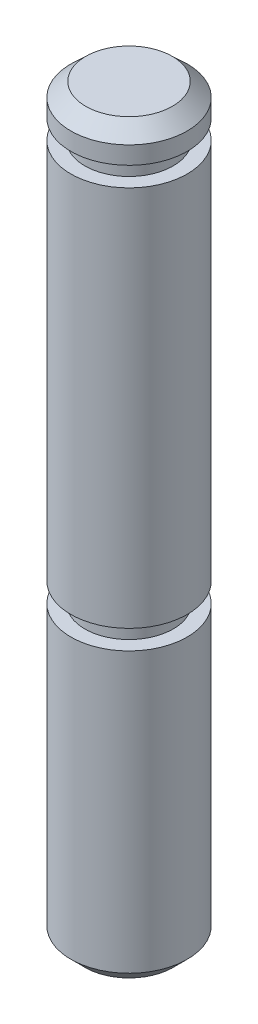
ISO-10303-21;
HEADER;
FILE_DESCRIPTION(('STEP AP214'),'2;1');
FILE_NAME('part.step','',(''),(''),'','','');
FILE_SCHEMA(('AUTOMOTIVE_DESIGN { 1 0 10303 214 1 1 1 1 }'));
ENDSEC;
DATA;
#1=APPLICATION_CONTEXT('core data for automotive mechanical design processes');
#2=APPLICATION_PROTOCOL_DEFINITION('international standard','automotive_design',2000,#1);
#3=PRODUCT_CONTEXT('',#1,'mechanical');
#4=PRODUCT('Part','Part','',(#3));
#5=PRODUCT_RELATED_PRODUCT_CATEGORY('part','',(#4));
#6=PRODUCT_DEFINITION_FORMATION('','',#4);
#7=PRODUCT_DEFINITION_CONTEXT('part definition',#1,'design');
#8=PRODUCT_DEFINITION('design','',#6,#7);
#9=PRODUCT_DEFINITION_SHAPE('','',#8);
#10=(LENGTH_UNIT() NAMED_UNIT(*) SI_UNIT(.MILLI.,.METRE.));
#11=(NAMED_UNIT(*) PLANE_ANGLE_UNIT() SI_UNIT($,.RADIAN.));
#12=(NAMED_UNIT(*) SI_UNIT($,.STERADIAN.) SOLID_ANGLE_UNIT());
#13=UNCERTAINTY_MEASURE_WITH_UNIT(LENGTH_MEASURE(1.E-05),#10,'distance_accuracy_value','');
#14=(GEOMETRIC_REPRESENTATION_CONTEXT(3) GLOBAL_UNCERTAINTY_ASSIGNED_CONTEXT((#13)) GLOBAL_UNIT_ASSIGNED_CONTEXT((#10,
#11,#12)) REPRESENTATION_CONTEXT('',''));
#15=CARTESIAN_POINT('',(0.,0.,0.));
#16=DIRECTION('',(0.,0.,1.));
#17=DIRECTION('',(1.,0.,0.));
#18=AXIS2_PLACEMENT_3D('',#15,#16,#17);
#19=CARTESIAN_POINT('',(-1.2065,-13.7414,0.));
#20=DIRECTION('',(0.,1.,0.));
#21=DIRECTION('',(0.,0.,1.));
#22=AXIS2_PLACEMENT_3D('',#19,#20,#21);
#23=PLANE('',#22);
#24=CARTESIAN_POINT('',(0.,-13.7414,0.));
#25=DIRECTION('',(0.,-1.,0.));
#26=DIRECTION('',(0.,0.,-1.));
#27=AXIS2_PLACEMENT_3D('',#24,#25,#26);
#28=CIRCLE('',#27,1.2065);
#29=CARTESIAN_POINT('',(0.,-13.7414,-1.2065));
#30=VERTEX_POINT('',#29);
#31=EDGE_CURVE('E10',#30,#30,#28,.T.);
#32=ORIENTED_EDGE('',*,*,#31,.T.);
#33=EDGE_LOOP('',(#32));
#34=FACE_BOUND('',#33,.T.);
#35=ADVANCED_FACE('F30',(#34),#23,.F.);
#36=CARTESIAN_POINT('',(0.,-13.3604,0.));
#37=DIRECTION('',(0.,1.,0.));
#38=DIRECTION('',(0.,0.,1.));
#39=AXIS2_PLACEMENT_3D('',#36,#37,#38);
#40=CONICAL_SURFACE('',#39,1.5875,0.78539816339745);
#41=ORIENTED_EDGE('',*,*,#31,.F.);
#42=EDGE_LOOP('',(#41));
#43=FACE_BOUND('',#42,.T.);
#44=CARTESIAN_POINT('',(0.,-13.3604,0.));
#45=DIRECTION('',(0.,-1.,0.));
#46=DIRECTION('',(0.,0.,-1.));
#47=AXIS2_PLACEMENT_3D('',#44,#45,#46);
#48=CIRCLE('',#47,1.5875);
#49=CARTESIAN_POINT('',(0.,-13.3604,-1.5875));
#50=VERTEX_POINT('',#49);
#51=EDGE_CURVE('E36',#50,#50,#48,.T.);
#52=ORIENTED_EDGE('',*,*,#51,.T.);
#53=EDGE_LOOP('',(#52));
#54=FACE_BOUND('',#53,.T.);
#55=ADVANCED_FACE('F86',(#43,#54),#40,.T.);
#56=CARTESIAN_POINT('',(0.,0.,0.));
#57=DIRECTION('',(0.,-1.,0.));
#58=DIRECTION('',(0.,0.,-1.));
#59=AXIS2_PLACEMENT_3D('',#56,#57,#58);
#60=CYLINDRICAL_SURFACE('',#59,1.5875);
#61=ORIENTED_EDGE('',*,*,#51,.F.);
#62=EDGE_LOOP('',(#61));
#63=FACE_BOUND('',#62,.T.);
#64=CARTESIAN_POINT('',(0.,-5.7404,0.));
#65=DIRECTION('',(0.,-1.,0.));
#66=DIRECTION('',(0.,0.,-1.));
#67=AXIS2_PLACEMENT_3D('',#64,#65,#66);
#68=CIRCLE('',#67,1.5875);
#69=CARTESIAN_POINT('',(0.,-5.7404,-1.5875));
#70=VERTEX_POINT('',#69);
#71=EDGE_CURVE('E40',#70,#70,#68,.T.);
#72=ORIENTED_EDGE('',*,*,#71,.T.);
#73=EDGE_LOOP('',(#72));
#74=FACE_BOUND('',#73,.T.);
#75=ADVANCED_FACE('F90',(#63,#74),#60,.T.);
#76=CARTESIAN_POINT('',(-1.2065,-5.7404,0.));
#77=DIRECTION('',(0.,-1.,0.));
#78=DIRECTION('',(0.,0.,-1.));
#79=AXIS2_PLACEMENT_3D('',#76,#77,#78);
#80=PLANE('',#79);
#81=ORIENTED_EDGE('',*,*,#71,.F.);
#82=EDGE_LOOP('',(#81));
#83=FACE_BOUND('',#82,.T.);
#84=CARTESIAN_POINT('',(0.,-5.7404,0.));
#85=DIRECTION('',(0.,-1.,0.));
#86=DIRECTION('',(0.,0.,-1.));
#87=AXIS2_PLACEMENT_3D('',#84,#85,#86);
#88=CIRCLE('',#87,1.2065);
#89=CARTESIAN_POINT('',(0.,-5.7404,-1.2065));
#90=VERTEX_POINT('',#89);
#91=EDGE_CURVE('E44',#90,#90,#88,.T.);
#92=ORIENTED_EDGE('',*,*,#91,.T.);
#93=EDGE_LOOP('',(#92));
#94=FACE_BOUND('',#93,.T.);
#95=ADVANCED_FACE('F95',(#83,#94),#80,.F.);
#96=CARTESIAN_POINT('',(0.,0.,0.));
#97=DIRECTION('',(0.,-1.,0.));
#98=DIRECTION('',(0.,0.,-1.));
#99=AXIS2_PLACEMENT_3D('',#96,#97,#98);
#100=CYLINDRICAL_SURFACE('',#99,1.2065);
#101=ORIENTED_EDGE('',*,*,#91,.F.);
#102=EDGE_LOOP('',(#101));
#103=FACE_BOUND('',#102,.T.);
#104=CARTESIAN_POINT('',(0.,-5.207,0.));
#105=DIRECTION('',(0.,-1.,0.));
#106=DIRECTION('',(0.,0.,-1.));
#107=AXIS2_PLACEMENT_3D('',#104,#105,#106);
#108=CIRCLE('',#107,1.2065);
#109=CARTESIAN_POINT('',(0.,-5.207,-1.2065));
#110=VERTEX_POINT('',#109);
#111=EDGE_CURVE('E49',#110,#110,#108,.T.);
#112=ORIENTED_EDGE('',*,*,#111,.T.);
#113=EDGE_LOOP('',(#112));
#114=FACE_BOUND('',#113,.T.);
#115=ADVANCED_FACE('F101',(#103,#114),#100,.T.);
#116=CARTESIAN_POINT('',(-1.5875,-5.207,0.));
#117=DIRECTION('',(0.,1.,0.));
#118=DIRECTION('',(0.,0.,1.));
#119=AXIS2_PLACEMENT_3D('',#116,#117,#118);
#120=PLANE('',#119);
#121=ORIENTED_EDGE('',*,*,#111,.F.);
#122=EDGE_LOOP('',(#121));
#123=FACE_BOUND('',#122,.T.);
#124=CARTESIAN_POINT('',(0.,-5.207,0.));
#125=DIRECTION('',(0.,-1.,0.));
#126=DIRECTION('',(0.,0.,-1.));
#127=AXIS2_PLACEMENT_3D('',#124,#125,#126);
#128=CIRCLE('',#127,1.5875);
#129=CARTESIAN_POINT('',(0.,-5.207,-1.5875));
#130=VERTEX_POINT('',#129);
#131=EDGE_CURVE('E52',#130,#130,#128,.T.);
#132=ORIENTED_EDGE('',*,*,#131,.T.);
#133=EDGE_LOOP('',(#132));
#134=FACE_BOUND('',#133,.T.);
#135=ADVANCED_FACE('F105',(#123,#134),#120,.F.);
#136=CARTESIAN_POINT('',(0.,0.,0.));
#137=DIRECTION('',(0.,-1.,0.));
#138=DIRECTION('',(0.,0.,-1.));
#139=AXIS2_PLACEMENT_3D('',#136,#137,#138);
#140=CYLINDRICAL_SURFACE('',#139,1.5875);
#141=ORIENTED_EDGE('',*,*,#131,.F.);
#142=EDGE_LOOP('',(#141));
#143=FACE_BOUND('',#142,.T.);
#144=CARTESIAN_POINT('',(0.,5.207,0.));
#145=DIRECTION('',(0.,-1.,0.));
#146=DIRECTION('',(0.,0.,-1.));
#147=AXIS2_PLACEMENT_3D('',#144,#145,#146);
#148=CIRCLE('',#147,1.5875);
#149=CARTESIAN_POINT('',(0.,5.207,-1.5875));
#150=VERTEX_POINT('',#149);
#151=EDGE_CURVE('E55',#150,#150,#148,.T.);
#152=ORIENTED_EDGE('',*,*,#151,.T.);
#153=EDGE_LOOP('',(#152));
#154=FACE_BOUND('',#153,.T.);
#155=ADVANCED_FACE('F109',(#143,#154),#140,.T.);
#156=CARTESIAN_POINT('',(-1.5875,5.207,0.));
#157=DIRECTION('',(0.,-1.,0.));
#158=DIRECTION('',(0.,0.,-1.));
#159=AXIS2_PLACEMENT_3D('',#156,#157,#158);
#160=PLANE('',#159);
#161=ORIENTED_EDGE('',*,*,#151,.F.);
#162=EDGE_LOOP('',(#161));
#163=FACE_BOUND('',#162,.T.);
#164=CARTESIAN_POINT('',(0.,5.207,0.));
#165=DIRECTION('',(0.,-1.,0.));
#166=DIRECTION('',(0.,0.,-1.));
#167=AXIS2_PLACEMENT_3D('',#164,#165,#166);
#168=CIRCLE('',#167,1.2065);
#169=CARTESIAN_POINT('',(0.,5.207,-1.2065));
#170=VERTEX_POINT('',#169);
#171=EDGE_CURVE('E58',#170,#170,#168,.T.);
#172=ORIENTED_EDGE('',*,*,#171,.T.);
#173=EDGE_LOOP('',(#172));
#174=FACE_BOUND('',#173,.T.);
#175=ADVANCED_FACE('F113',(#163,#174),#160,.F.);
#176=CARTESIAN_POINT('',(0.,0.,0.));
#177=DIRECTION('',(0.,-1.,0.));
#178=DIRECTION('',(0.,0.,-1.));
#179=AXIS2_PLACEMENT_3D('',#176,#177,#178);
#180=CYLINDRICAL_SURFACE('',#179,1.2065);
#181=ORIENTED_EDGE('',*,*,#171,.F.);
#182=EDGE_LOOP('',(#181));
#183=FACE_BOUND('',#182,.T.);
#184=CARTESIAN_POINT('',(0.,5.7404,0.));
#185=DIRECTION('',(0.,-1.,0.));
#186=DIRECTION('',(0.,0.,-1.));
#187=AXIS2_PLACEMENT_3D('',#184,#185,#186);
#188=CIRCLE('',#187,1.2065);
#189=CARTESIAN_POINT('',(0.,5.7404,-1.2065));
#190=VERTEX_POINT('',#189);
#191=EDGE_CURVE('E61',#190,#190,#188,.T.);
#192=ORIENTED_EDGE('',*,*,#191,.T.);
#193=EDGE_LOOP('',(#192));
#194=FACE_BOUND('',#193,.T.);
#195=ADVANCED_FACE('F117',(#183,#194),#180,.T.);
#196=CARTESIAN_POINT('',(-1.2065,5.7404,0.));
#197=DIRECTION('',(0.,1.,0.));
#198=DIRECTION('',(0.,0.,1.));
#199=AXIS2_PLACEMENT_3D('',#196,#197,#198);
#200=PLANE('',#199);
#201=ORIENTED_EDGE('',*,*,#191,.F.);
#202=EDGE_LOOP('',(#201));
#203=FACE_BOUND('',#202,.T.);
#204=CARTESIAN_POINT('',(0.,5.7404,0.));
#205=DIRECTION('',(0.,-1.,0.));
#206=DIRECTION('',(0.,0.,-1.));
#207=AXIS2_PLACEMENT_3D('',#204,#205,#206);
#208=CIRCLE('',#207,1.5875);
#209=CARTESIAN_POINT('',(0.,5.7404,-1.5875));
#210=VERTEX_POINT('',#209);
#211=EDGE_CURVE('E64',#210,#210,#208,.T.);
#212=ORIENTED_EDGE('',*,*,#211,.T.);
#213=EDGE_LOOP('',(#212));
#214=FACE_BOUND('',#213,.T.);
#215=ADVANCED_FACE('F121',(#203,#214),#200,.F.);
#216=CARTESIAN_POINT('',(0.,0.,0.));
#217=DIRECTION('',(0.,-1.,0.));
#218=DIRECTION('',(0.,0.,-1.));
#219=AXIS2_PLACEMENT_3D('',#216,#217,#218);
#220=CYLINDRICAL_SURFACE('',#219,1.5875);
#221=ORIENTED_EDGE('',*,*,#211,.F.);
#222=EDGE_LOOP('',(#221));
#223=FACE_BOUND('',#222,.T.);
#224=CARTESIAN_POINT('',(0.,6.223,0.));
#225=DIRECTION('',(0.,-1.,0.));
#226=DIRECTION('',(0.,0.,-1.));
#227=AXIS2_PLACEMENT_3D('',#224,#225,#226);
#228=CIRCLE('',#227,1.5875);
#229=CARTESIAN_POINT('',(0.,6.223,-1.5875));
#230=VERTEX_POINT('',#229);
#231=EDGE_CURVE('E67',#230,#230,#228,.T.);
#232=ORIENTED_EDGE('',*,*,#231,.T.);
#233=EDGE_LOOP('',(#232));
#234=FACE_BOUND('',#233,.T.);
#235=ADVANCED_FACE('F82',(#223,#234),#220,.T.);
#236=CARTESIAN_POINT('',(0.,6.604,0.));
#237=DIRECTION('',(0.,-1.,0.));
#238=DIRECTION('',(0.,0.,-1.));
#239=AXIS2_PLACEMENT_3D('',#236,#237,#238);
#240=CONICAL_SURFACE('',#239,1.18278756142947,0.815568544068997);
#241=ORIENTED_EDGE('',*,*,#231,.F.);
#242=EDGE_LOOP('',(#241));
#243=FACE_BOUND('',#242,.T.);
#244=CARTESIAN_POINT('',(0.,6.604,0.));
#245=DIRECTION('',(0.,-1.,0.));
#246=DIRECTION('',(0.,0.,-1.));
#247=AXIS2_PLACEMENT_3D('',#244,#245,#246);
#248=CIRCLE('',#247,1.18278756142947);
#249=CARTESIAN_POINT('',(0.,6.604,-1.18278756142947));
#250=VERTEX_POINT('',#249);
#251=EDGE_CURVE('E70',#250,#250,#248,.T.);
#252=ORIENTED_EDGE('',*,*,#251,.T.);
#253=EDGE_LOOP('',(#252));
#254=FACE_BOUND('',#253,.T.);
#255=ADVANCED_FACE('F74',(#243,#254),#240,.T.);
#256=CARTESIAN_POINT('',(-1.18278756142947,6.604,0.));
#257=DIRECTION('',(0.,-1.,0.));
#258=DIRECTION('',(0.,0.,-1.));
#259=AXIS2_PLACEMENT_3D('',#256,#257,#258);
#260=PLANE('',#259);
#261=ORIENTED_EDGE('',*,*,#251,.F.);
#262=EDGE_LOOP('',(#261));
#263=FACE_BOUND('',#262,.T.);
#264=ADVANCED_FACE('F76',(#263),#260,.F.);
#265=CLOSED_SHELL('',(#35,#55,#75,#95,#115,#135,#155,#175,#195,#215,#235,#255,#264));
#266=MANIFOLD_SOLID_BREP('B2',#265);
#267=ADVANCED_BREP_SHAPE_REPRESENTATION('',(#18,#266),#14);
#268=SHAPE_DEFINITION_REPRESENTATION(#9,#267);
ENDSEC;
END-ISO-10303-21;
